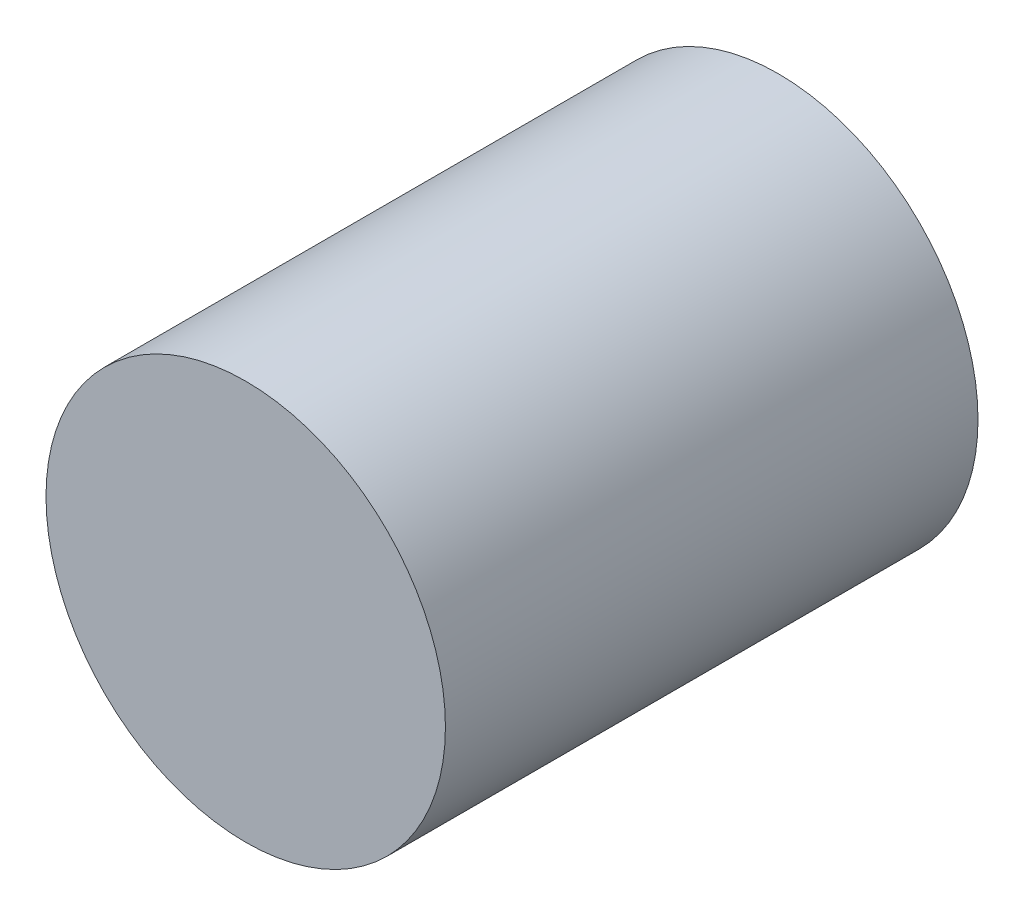
ISO-10303-21;
HEADER;
FILE_DESCRIPTION(('STEP AP214'),'2;1');
FILE_NAME('part.step','',(''),(''),'','','');
FILE_SCHEMA(('AUTOMOTIVE_DESIGN { 1 0 10303 214 1 1 1 1 }'));
ENDSEC;
DATA;
#1=APPLICATION_CONTEXT('core data for automotive mechanical design processes');
#2=APPLICATION_PROTOCOL_DEFINITION('international standard','automotive_design',2000,#1);
#3=PRODUCT_CONTEXT('',#1,'mechanical');
#4=PRODUCT('Part','Part','',(#3));
#5=PRODUCT_RELATED_PRODUCT_CATEGORY('part','',(#4));
#6=PRODUCT_DEFINITION_FORMATION('','',#4);
#7=PRODUCT_DEFINITION_CONTEXT('part definition',#1,'design');
#8=PRODUCT_DEFINITION('design','',#6,#7);
#9=PRODUCT_DEFINITION_SHAPE('','',#8);
#10=(LENGTH_UNIT() NAMED_UNIT(*) SI_UNIT(.MILLI.,.METRE.));
#11=(NAMED_UNIT(*) PLANE_ANGLE_UNIT() SI_UNIT($,.RADIAN.));
#12=(NAMED_UNIT(*) SI_UNIT($,.STERADIAN.) SOLID_ANGLE_UNIT());
#13=UNCERTAINTY_MEASURE_WITH_UNIT(LENGTH_MEASURE(1.E-05),#10,'distance_accuracy_value','');
#14=(GEOMETRIC_REPRESENTATION_CONTEXT(3) GLOBAL_UNCERTAINTY_ASSIGNED_CONTEXT((#13)) GLOBAL_UNIT_ASSIGNED_CONTEXT((#10,
#11,#12)) REPRESENTATION_CONTEXT('',''));
#15=CARTESIAN_POINT('',(0.,0.,0.));
#16=DIRECTION('',(0.,0.,1.));
#17=DIRECTION('',(1.,0.,0.));
#18=AXIS2_PLACEMENT_3D('',#15,#16,#17);
#19=CARTESIAN_POINT('',(0.,0.,100.));
#20=DIRECTION('',(0.,0.,-1.));
#21=DIRECTION('',(-1.,0.,0.));
#22=AXIS2_PLACEMENT_3D('',#19,#20,#21);
#23=CYLINDRICAL_SURFACE('',#22,37.5);
#24=CARTESIAN_POINT('',(0.,0.,100.));
#25=DIRECTION('',(0.,0.,1.));
#26=DIRECTION('',(1.,0.,0.));
#27=AXIS2_PLACEMENT_3D('',#24,#25,#26);
#28=CIRCLE('',#27,37.5);
#29=CARTESIAN_POINT('',(37.5,0.,100.));
#30=VERTEX_POINT('',#29);
#31=EDGE_CURVE('E10',#30,#30,#28,.T.);
#32=ORIENTED_EDGE('',*,*,#31,.F.);
#33=EDGE_LOOP('',(#32));
#34=FACE_BOUND('',#33,.T.);
#35=CARTESIAN_POINT('',(0.,0.,0.));
#36=DIRECTION('',(0.,0.,1.));
#37=DIRECTION('',(1.,0.,0.));
#38=AXIS2_PLACEMENT_3D('',#35,#36,#37);
#39=CIRCLE('',#38,37.5);
#40=CARTESIAN_POINT('',(37.5,0.,0.));
#41=VERTEX_POINT('',#40);
#42=EDGE_CURVE('E37',#41,#41,#39,.T.);
#43=ORIENTED_EDGE('',*,*,#42,.T.);
#44=EDGE_LOOP('',(#43));
#45=FACE_BOUND('',#44,.T.);
#46=ADVANCED_FACE('F34',(#34,#45),#23,.T.);
#47=CARTESIAN_POINT('',(0.,0.,100.));
#48=DIRECTION('',(0.,0.,1.));
#49=DIRECTION('',(1.,0.,0.));
#50=AXIS2_PLACEMENT_3D('',#47,#48,#49);
#51=PLANE('',#50);
#52=ORIENTED_EDGE('',*,*,#31,.T.);
#53=EDGE_LOOP('',(#52));
#54=FACE_BOUND('',#53,.T.);
#55=ADVANCED_FACE('F49',(#54),#51,.T.);
#56=CARTESIAN_POINT('',(0.,0.,0.));
#57=DIRECTION('',(0.,0.,1.));
#58=DIRECTION('',(1.,0.,0.));
#59=AXIS2_PLACEMENT_3D('',#56,#57,#58);
#60=PLANE('',#59);
#61=ORIENTED_EDGE('',*,*,#42,.F.);
#62=EDGE_LOOP('',(#61));
#63=FACE_BOUND('',#62,.T.);
#64=ADVANCED_FACE('F47',(#63),#60,.F.);
#65=CLOSED_SHELL('',(#46,#55,#64));
#66=MANIFOLD_SOLID_BREP('B2',#65);
#67=ADVANCED_BREP_SHAPE_REPRESENTATION('',(#18,#66),#14);
#68=SHAPE_DEFINITION_REPRESENTATION(#9,#67);
ENDSEC;
END-ISO-10303-21;
